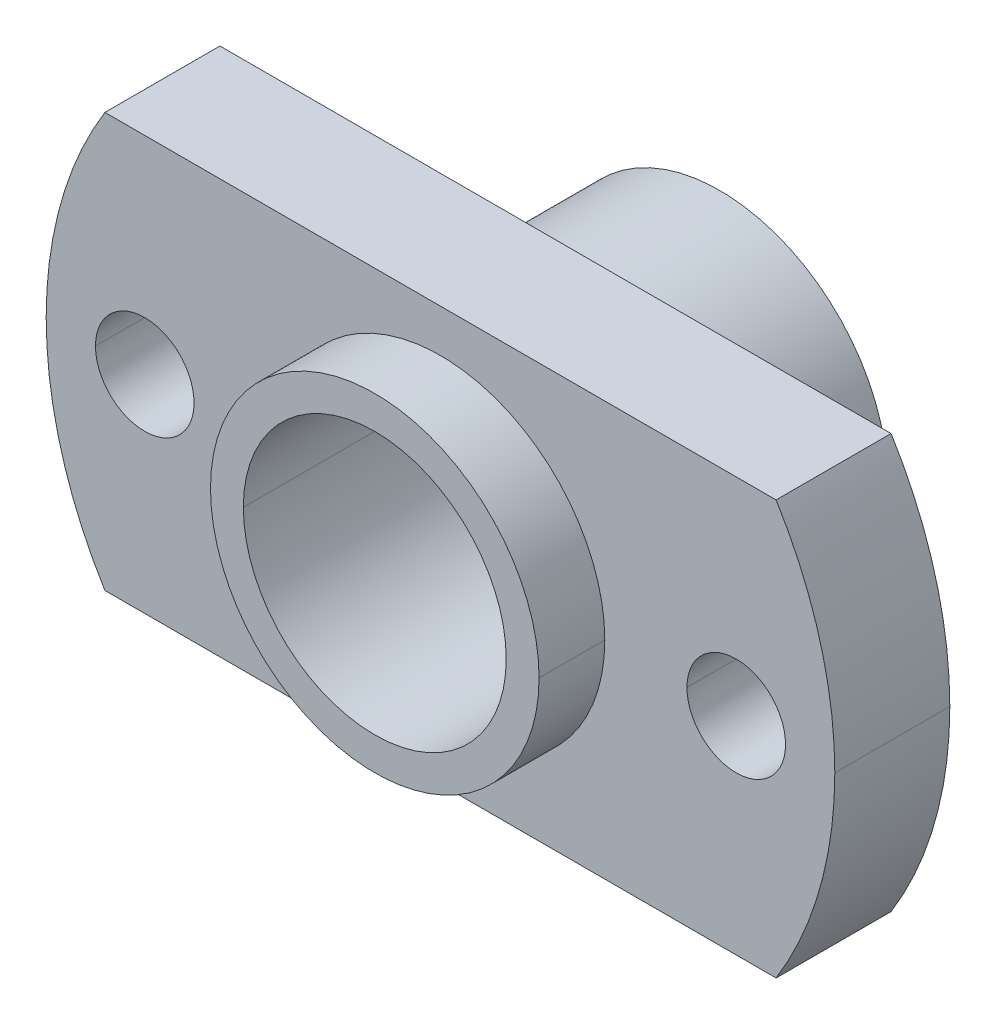
ISO-10303-21;
HEADER;
FILE_DESCRIPTION(('STEP AP214'),'2;1');
FILE_NAME('part.step','',(''),(''),'','','');
FILE_SCHEMA(('AUTOMOTIVE_DESIGN { 1 0 10303 214 1 1 1 1 }'));
ENDSEC;
DATA;
#1=APPLICATION_CONTEXT('core data for automotive mechanical design processes');
#2=APPLICATION_PROTOCOL_DEFINITION('international standard','automotive_design',2000,#1);
#3=PRODUCT_CONTEXT('',#1,'mechanical');
#4=PRODUCT('Part','Part','',(#3));
#5=PRODUCT_RELATED_PRODUCT_CATEGORY('part','',(#4));
#6=PRODUCT_DEFINITION_FORMATION('','',#4);
#7=PRODUCT_DEFINITION_CONTEXT('part definition',#1,'design');
#8=PRODUCT_DEFINITION('design','',#6,#7);
#9=PRODUCT_DEFINITION_SHAPE('','',#8);
#10=(LENGTH_UNIT() NAMED_UNIT(*) SI_UNIT(.MILLI.,.METRE.));
#11=(NAMED_UNIT(*) PLANE_ANGLE_UNIT() SI_UNIT($,.RADIAN.));
#12=(NAMED_UNIT(*) SI_UNIT($,.STERADIAN.) SOLID_ANGLE_UNIT());
#13=UNCERTAINTY_MEASURE_WITH_UNIT(LENGTH_MEASURE(1.E-05),#10,'distance_accuracy_value','');
#14=(GEOMETRIC_REPRESENTATION_CONTEXT(3) GLOBAL_UNCERTAINTY_ASSIGNED_CONTEXT((#13)) GLOBAL_UNIT_ASSIGNED_CONTEXT((#10,
#11,#12)) REPRESENTATION_CONTEXT('',''));
#15=CARTESIAN_POINT('',(0.,0.,0.));
#16=DIRECTION('',(0.,0.,1.));
#17=DIRECTION('',(1.,0.,0.));
#18=AXIS2_PLACEMENT_3D('',#15,#16,#17);
#19=CARTESIAN_POINT('',(0.,0.,2.));
#20=DIRECTION('',(0.,0.,-1.));
#21=DIRECTION('',(-1.,0.,0.));
#22=AXIS2_PLACEMENT_3D('',#19,#20,#21);
#23=CYLINDRICAL_SURFACE('',#22,4.);
#24=DIRECTION('',(0.,0.,-1.));
#25=VECTOR('',#24,1.);
#26=CARTESIAN_POINT('',(4.,0.,2.));
#27=LINE('',#26,#25);
#28=CARTESIAN_POINT('',(4.,0.,2.));
#29=VERTEX_POINT('',#28);
#30=CARTESIAN_POINT('',(4.,0.,-8.5));
#31=VERTEX_POINT('',#30);
#32=EDGE_CURVE('E174',#29,#31,#27,.T.);
#33=ORIENTED_EDGE('',*,*,#32,.F.);
#34=CARTESIAN_POINT('',(0.,0.,2.));
#35=DIRECTION('',(0.,0.,-1.));
#36=DIRECTION('',(-1.,0.,0.));
#37=AXIS2_PLACEMENT_3D('',#34,#35,#36);
#38=CIRCLE('',#37,4.);
#39=CARTESIAN_POINT('',(-4.,0.,2.));
#40=VERTEX_POINT('',#39);
#41=EDGE_CURVE('E161',#40,#29,#38,.T.);
#42=ORIENTED_EDGE('',*,*,#41,.F.);
#43=DIRECTION('',(0.,0.,-1.));
#44=VECTOR('',#43,1.);
#45=CARTESIAN_POINT('',(-4.,0.,2.));
#46=LINE('',#45,#44);
#47=CARTESIAN_POINT('',(-4.,0.,-8.5));
#48=VERTEX_POINT('',#47);
#49=EDGE_CURVE('E182',#40,#48,#46,.T.);
#50=ORIENTED_EDGE('',*,*,#49,.T.);
#51=CARTESIAN_POINT('',(0.,0.,-8.5));
#52=DIRECTION('',(0.,0.,-1.));
#53=DIRECTION('',(-1.,0.,0.));
#54=AXIS2_PLACEMENT_3D('',#51,#52,#53);
#55=CIRCLE('',#54,4.);
#56=EDGE_CURVE('E11',#48,#31,#55,.T.);
#57=ORIENTED_EDGE('',*,*,#56,.T.);
#58=EDGE_LOOP('',(#33,#42,#50,#57));
#59=FACE_BOUND('',#58,.T.);
#60=ADVANCED_FACE('F17',(#59),#23,.F.);
#61=CARTESIAN_POINT('',(0.,0.,-8.5));
#62=DIRECTION('',(0.,0.,-1.));
#63=DIRECTION('',(0.,-1.,0.));
#64=AXIS2_PLACEMENT_3D('',#61,#62,#63);
#65=PLANE('',#64);
#66=ORIENTED_EDGE('',*,*,#56,.F.);
#67=CARTESIAN_POINT('',(0.,0.,-8.5));
#68=DIRECTION('',(0.,0.,-1.));
#69=DIRECTION('',(-1.,0.,0.));
#70=AXIS2_PLACEMENT_3D('',#67,#68,#69);
#71=CIRCLE('',#70,4.);
#72=EDGE_CURVE('E179',#31,#48,#71,.T.);
#73=ORIENTED_EDGE('',*,*,#72,.F.);
#74=EDGE_LOOP('',(#66,#73));
#75=FACE_BOUND('',#74,.T.);
#76=CARTESIAN_POINT('',(0.,0.,-8.5));
#77=DIRECTION('',(0.,0.,-1.));
#78=DIRECTION('',(-1.,0.,0.));
#79=AXIS2_PLACEMENT_3D('',#76,#77,#78);
#80=CIRCLE('',#79,5.1);
#81=CARTESIAN_POINT('',(5.1,0.,-8.5));
#82=VERTEX_POINT('',#81);
#83=CARTESIAN_POINT('',(-5.1,0.,-8.5));
#84=VERTEX_POINT('',#83);
#85=EDGE_CURVE('E25',#82,#84,#80,.T.);
#86=ORIENTED_EDGE('',*,*,#85,.T.);
#87=CARTESIAN_POINT('',(0.,0.,-8.5));
#88=DIRECTION('',(0.,0.,-1.));
#89=DIRECTION('',(-1.,0.,0.));
#90=AXIS2_PLACEMENT_3D('',#87,#88,#89);
#91=CIRCLE('',#90,5.1);
#92=EDGE_CURVE('E214',#84,#82,#91,.T.);
#93=ORIENTED_EDGE('',*,*,#92,.T.);
#94=EDGE_LOOP('',(#86,#93));
#95=FACE_BOUND('',#94,.T.);
#96=ADVANCED_FACE('F331',(#75,#95),#65,.T.);
#97=CARTESIAN_POINT('',(0.,0.,-8.5));
#98=DIRECTION('',(0.,0.,1.));
#99=DIRECTION('',(1.,0.,0.));
#100=AXIS2_PLACEMENT_3D('',#97,#98,#99);
#101=CYLINDRICAL_SURFACE('',#100,5.1);
#102=DIRECTION('',(0.,0.,1.));
#103=VECTOR('',#102,1.);
#104=CARTESIAN_POINT('',(-5.1,0.,-8.5));
#105=LINE('',#104,#103);
#106=CARTESIAN_POINT('',(-5.1,0.,-3.5));
#107=VERTEX_POINT('',#106);
#108=EDGE_CURVE('E218',#84,#107,#105,.T.);
#109=ORIENTED_EDGE('',*,*,#108,.F.);
#110=ORIENTED_EDGE('',*,*,#85,.F.);
#111=DIRECTION('',(0.,0.,1.));
#112=VECTOR('',#111,1.);
#113=CARTESIAN_POINT('',(5.1,0.,-8.5));
#114=LINE('',#113,#112);
#115=CARTESIAN_POINT('',(5.1,0.,-3.5));
#116=VERTEX_POINT('',#115);
#117=EDGE_CURVE('E228',#82,#116,#114,.T.);
#118=ORIENTED_EDGE('',*,*,#117,.T.);
#119=CARTESIAN_POINT('',(0.,0.,-3.5));
#120=DIRECTION('',(0.,0.,-1.));
#121=DIRECTION('',(1.,0.,0.));
#122=AXIS2_PLACEMENT_3D('',#119,#120,#121);
#123=CIRCLE('',#122,5.1);
#124=EDGE_CURVE('E307',#116,#107,#123,.T.);
#125=ORIENTED_EDGE('',*,*,#124,.T.);
#126=EDGE_LOOP('',(#109,#110,#118,#125));
#127=FACE_BOUND('',#126,.T.);
#128=ADVANCED_FACE('F335',(#127),#101,.T.);
#129=CARTESIAN_POINT('',(0.,0.,2.));
#130=DIRECTION('',(0.,0.,1.));
#131=DIRECTION('',(1.,0.,0.));
#132=AXIS2_PLACEMENT_3D('',#129,#130,#131);
#133=PLANE('',#132);
#134=ORIENTED_EDGE('',*,*,#41,.T.);
#135=CARTESIAN_POINT('',(0.,0.,2.));
#136=DIRECTION('',(0.,0.,-1.));
#137=DIRECTION('',(-1.,0.,0.));
#138=AXIS2_PLACEMENT_3D('',#135,#136,#137);
#139=CIRCLE('',#138,4.);
#140=EDGE_CURVE('E166',#29,#40,#139,.T.);
#141=ORIENTED_EDGE('',*,*,#140,.T.);
#142=EDGE_LOOP('',(#134,#141));
#143=FACE_BOUND('',#142,.T.);
#144=CARTESIAN_POINT('',(0.,0.,2.));
#145=DIRECTION('',(0.,0.,1.));
#146=DIRECTION('',(1.,0.,0.));
#147=AXIS2_PLACEMENT_3D('',#144,#145,#146);
#148=CIRCLE('',#147,5.);
#149=CARTESIAN_POINT('',(-5.,0.,2.));
#150=VERTEX_POINT('',#149);
#151=CARTESIAN_POINT('',(5.,0.,2.));
#152=VERTEX_POINT('',#151);
#153=EDGE_CURVE('E171',#150,#152,#148,.T.);
#154=ORIENTED_EDGE('',*,*,#153,.T.);
#155=CARTESIAN_POINT('',(0.,0.,2.));
#156=DIRECTION('',(0.,0.,1.));
#157=DIRECTION('',(1.,0.,0.));
#158=AXIS2_PLACEMENT_3D('',#155,#156,#157);
#159=CIRCLE('',#158,5.);
#160=EDGE_CURVE('E232',#152,#150,#159,.T.);
#161=ORIENTED_EDGE('',*,*,#160,.T.);
#162=EDGE_LOOP('',(#154,#161));
#163=FACE_BOUND('',#162,.T.);
#164=ADVANCED_FACE('F163',(#143,#163),#133,.T.);
#165=CARTESIAN_POINT('',(0.,0.,2.));
#166=DIRECTION('',(0.,0.,-1.));
#167=DIRECTION('',(-1.,0.,0.));
#168=AXIS2_PLACEMENT_3D('',#165,#166,#167);
#169=CYLINDRICAL_SURFACE('',#168,5.);
#170=DIRECTION('',(0.,0.,-1.));
#171=VECTOR('',#170,1.);
#172=CARTESIAN_POINT('',(5.,0.,2.));
#173=LINE('',#172,#171);
#174=CARTESIAN_POINT('',(5.,0.,0.));
#175=VERTEX_POINT('',#174);
#176=EDGE_CURVE('E199',#152,#175,#173,.T.);
#177=ORIENTED_EDGE('',*,*,#176,.F.);
#178=ORIENTED_EDGE('',*,*,#153,.F.);
#179=DIRECTION('',(0.,0.,-1.));
#180=VECTOR('',#179,1.);
#181=CARTESIAN_POINT('',(-5.,0.,2.));
#182=LINE('',#181,#180);
#183=CARTESIAN_POINT('',(-5.,0.,0.));
#184=VERTEX_POINT('',#183);
#185=EDGE_CURVE('E194',#150,#184,#182,.T.);
#186=ORIENTED_EDGE('',*,*,#185,.T.);
#187=CARTESIAN_POINT('',(0.,0.,0.));
#188=DIRECTION('',(0.,0.,1.));
#189=DIRECTION('',(1.,0.,0.));
#190=AXIS2_PLACEMENT_3D('',#187,#188,#189);
#191=CIRCLE('',#190,5.);
#192=EDGE_CURVE('E316',#184,#175,#191,.T.);
#193=ORIENTED_EDGE('',*,*,#192,.T.);
#194=EDGE_LOOP('',(#177,#178,#186,#193));
#195=FACE_BOUND('',#194,.T.);
#196=ADVANCED_FACE('F385',(#195),#169,.T.);
#197=CARTESIAN_POINT('',(9.,0.,-3.5));
#198=DIRECTION('',(0.,0.,1.));
#199=DIRECTION('',(1.,0.,0.));
#200=AXIS2_PLACEMENT_3D('',#197,#198,#199);
#201=CYLINDRICAL_SURFACE('',#200,1.5);
#202=DIRECTION('',(0.,0.,1.));
#203=VECTOR('',#202,1.);
#204=CARTESIAN_POINT('',(7.5,0.,-3.5));
#205=LINE('',#204,#203);
#206=CARTESIAN_POINT('',(7.5,0.,-3.5));
#207=VERTEX_POINT('',#206);
#208=CARTESIAN_POINT('',(7.5,0.,0.));
#209=VERTEX_POINT('',#208);
#210=EDGE_CURVE('E193',#207,#209,#205,.T.);
#211=ORIENTED_EDGE('',*,*,#210,.F.);
#212=CARTESIAN_POINT('',(9.,0.,-3.5));
#213=DIRECTION('',(0.,0.,1.));
#214=DIRECTION('',(-1.,0.,0.));
#215=AXIS2_PLACEMENT_3D('',#212,#213,#214);
#216=CIRCLE('',#215,1.5);
#217=CARTESIAN_POINT('',(10.5,0.,-3.5));
#218=VERTEX_POINT('',#217);
#219=EDGE_CURVE('E308',#218,#207,#216,.T.);
#220=ORIENTED_EDGE('',*,*,#219,.F.);
#221=DIRECTION('',(0.,0.,1.));
#222=VECTOR('',#221,1.);
#223=CARTESIAN_POINT('',(10.5,0.,-3.5));
#224=LINE('',#223,#222);
#225=CARTESIAN_POINT('',(10.5,0.,0.));
#226=VERTEX_POINT('',#225);
#227=EDGE_CURVE('E237',#218,#226,#224,.T.);
#228=ORIENTED_EDGE('',*,*,#227,.T.);
#229=CARTESIAN_POINT('',(9.,0.,0.));
#230=DIRECTION('',(0.,0.,1.));
#231=DIRECTION('',(-1.,0.,0.));
#232=AXIS2_PLACEMENT_3D('',#229,#230,#231);
#233=CIRCLE('',#232,1.5);
#234=EDGE_CURVE('E319',#226,#209,#233,.T.);
#235=ORIENTED_EDGE('',*,*,#234,.T.);
#236=EDGE_LOOP('',(#211,#220,#228,#235));
#237=FACE_BOUND('',#236,.T.);
#238=ADVANCED_FACE('F387',(#237),#201,.F.);
#239=CARTESIAN_POINT('',(-9.,0.,-3.5));
#240=DIRECTION('',(0.,0.,1.));
#241=DIRECTION('',(1.,0.,0.));
#242=AXIS2_PLACEMENT_3D('',#239,#240,#241);
#243=CYLINDRICAL_SURFACE('',#242,1.5);
#244=DIRECTION('',(0.,0.,1.));
#245=VECTOR('',#244,1.);
#246=CARTESIAN_POINT('',(-10.5,0.,-3.5));
#247=LINE('',#246,#245);
#248=CARTESIAN_POINT('',(-10.5,0.,-3.5));
#249=VERTEX_POINT('',#248);
#250=CARTESIAN_POINT('',(-10.5,0.,0.));
#251=VERTEX_POINT('',#250);
#252=EDGE_CURVE('E261',#249,#251,#247,.T.);
#253=ORIENTED_EDGE('',*,*,#252,.F.);
#254=CARTESIAN_POINT('',(-9.,0.,-3.5));
#255=DIRECTION('',(0.,0.,1.));
#256=DIRECTION('',(1.,0.,0.));
#257=AXIS2_PLACEMENT_3D('',#254,#255,#256);
#258=CIRCLE('',#257,1.5);
#259=CARTESIAN_POINT('',(-7.5,0.,-3.5));
#260=VERTEX_POINT('',#259);
#261=EDGE_CURVE('E311',#260,#249,#258,.T.);
#262=ORIENTED_EDGE('',*,*,#261,.F.);
#263=DIRECTION('',(0.,0.,1.));
#264=VECTOR('',#263,1.);
#265=CARTESIAN_POINT('',(-7.5,0.,-3.5));
#266=LINE('',#265,#264);
#267=CARTESIAN_POINT('',(-7.5,0.,0.));
#268=VERTEX_POINT('',#267);
#269=EDGE_CURVE('E200',#260,#268,#266,.T.);
#270=ORIENTED_EDGE('',*,*,#269,.T.);
#271=CARTESIAN_POINT('',(-9.,0.,0.));
#272=DIRECTION('',(0.,0.,1.));
#273=DIRECTION('',(1.,0.,0.));
#274=AXIS2_PLACEMENT_3D('',#271,#272,#273);
#275=CIRCLE('',#274,1.5);
#276=EDGE_CURVE('E322',#268,#251,#275,.T.);
#277=ORIENTED_EDGE('',*,*,#276,.T.);
#278=EDGE_LOOP('',(#253,#262,#270,#277));
#279=FACE_BOUND('',#278,.T.);
#280=ADVANCED_FACE('F390',(#279),#243,.F.);
#281=CARTESIAN_POINT('',(0.,0.,0.));
#282=DIRECTION('',(0.,0.,1.));
#283=DIRECTION('',(1.,0.,0.));
#284=AXIS2_PLACEMENT_3D('',#281,#282,#283);
#285=PLANE('',#284);
#286=ORIENTED_EDGE('',*,*,#276,.F.);
#287=CARTESIAN_POINT('',(-9.,0.,0.));
#288=DIRECTION('',(0.,0.,1.));
#289=DIRECTION('',(1.,0.,0.));
#290=AXIS2_PLACEMENT_3D('',#287,#288,#289);
#291=CIRCLE('',#290,1.5);
#292=EDGE_CURVE('E204',#251,#268,#291,.T.);
#293=ORIENTED_EDGE('',*,*,#292,.F.);
#294=EDGE_LOOP('',(#286,#293));
#295=FACE_BOUND('',#294,.T.);
#296=ORIENTED_EDGE('',*,*,#234,.F.);
#297=CARTESIAN_POINT('',(9.,0.,0.));
#298=DIRECTION('',(0.,0.,1.));
#299=DIRECTION('',(-1.,0.,0.));
#300=AXIS2_PLACEMENT_3D('',#297,#298,#299);
#301=CIRCLE('',#300,1.5);
#302=EDGE_CURVE('E233',#209,#226,#301,.T.);
#303=ORIENTED_EDGE('',*,*,#302,.F.);
#304=EDGE_LOOP('',(#296,#303));
#305=FACE_BOUND('',#304,.T.);
#306=ORIENTED_EDGE('',*,*,#192,.F.);
#307=CARTESIAN_POINT('',(0.,0.,0.));
#308=DIRECTION('',(0.,0.,1.));
#309=DIRECTION('',(1.,0.,0.));
#310=AXIS2_PLACEMENT_3D('',#307,#308,#309);
#311=CIRCLE('',#310,5.);
#312=EDGE_CURVE('E195',#175,#184,#311,.T.);
#313=ORIENTED_EDGE('',*,*,#312,.F.);
#314=EDGE_LOOP('',(#306,#313));
#315=FACE_BOUND('',#314,.T.);
#316=CARTESIAN_POINT('',(0.,0.,0.));
#317=DIRECTION('',(0.,0.,1.));
#318=DIRECTION('',(1.,0.,0.));
#319=AXIS2_PLACEMENT_3D('',#316,#317,#318);
#320=CIRCLE('',#319,12.);
#321=CARTESIAN_POINT('',(-10.2132267183295,6.3,0.));
#322=VERTEX_POINT('',#321);
#323=CARTESIAN_POINT('',(-10.2132267183295,-6.3,0.));
#324=VERTEX_POINT('',#323);
#325=EDGE_CURVE('E276',#322,#324,#320,.T.);
#326=ORIENTED_EDGE('',*,*,#325,.T.);
#327=DIRECTION('',(1.,0.,0.));
#328=VECTOR('',#327,1.);
#329=CARTESIAN_POINT('',(-10.2132267183295,-6.3,0.));
#330=LINE('',#329,#328);
#331=CARTESIAN_POINT('',(10.2132267183295,-6.3,0.));
#332=VERTEX_POINT('',#331);
#333=EDGE_CURVE('E247',#324,#332,#330,.T.);
#334=ORIENTED_EDGE('',*,*,#333,.T.);
#335=CARTESIAN_POINT('',(0.,0.,0.));
#336=DIRECTION('',(0.,0.,1.));
#337=DIRECTION('',(1.,0.,0.));
#338=AXIS2_PLACEMENT_3D('',#335,#336,#337);
#339=CIRCLE('',#338,12.);
#340=CARTESIAN_POINT('',(12.,0.,0.));
#341=VERTEX_POINT('',#340);
#342=EDGE_CURVE('E275',#332,#341,#339,.T.);
#343=ORIENTED_EDGE('',*,*,#342,.T.);
#344=CARTESIAN_POINT('',(0.,0.,0.));
#345=DIRECTION('',(0.,0.,1.));
#346=DIRECTION('',(1.,0.,0.));
#347=AXIS2_PLACEMENT_3D('',#344,#345,#346);
#348=CIRCLE('',#347,12.);
#349=CARTESIAN_POINT('',(10.2132267183295,6.3,0.));
#350=VERTEX_POINT('',#349);
#351=EDGE_CURVE('E49',#341,#350,#348,.T.);
#352=ORIENTED_EDGE('',*,*,#351,.T.);
#353=DIRECTION('',(-1.,0.,0.));
#354=VECTOR('',#353,1.);
#355=CARTESIAN_POINT('',(-10.2132267183295,6.3,0.));
#356=LINE('',#355,#354);
#357=EDGE_CURVE('E212',#350,#322,#356,.T.);
#358=ORIENTED_EDGE('',*,*,#357,.T.);
#359=EDGE_LOOP('',(#326,#334,#343,#352,#358));
#360=FACE_BOUND('',#359,.T.);
#361=ADVANCED_FACE('F344',(#295,#305,#315,#360),#285,.T.);
#362=CARTESIAN_POINT('',(0.,0.,-3.5));
#363=DIRECTION('',(0.,0.,1.));
#364=DIRECTION('',(1.,0.,0.));
#365=AXIS2_PLACEMENT_3D('',#362,#363,#364);
#366=PLANE('',#365);
#367=ORIENTED_EDGE('',*,*,#261,.T.);
#368=CARTESIAN_POINT('',(-9.,0.,-3.5));
#369=DIRECTION('',(0.,0.,1.));
#370=DIRECTION('',(1.,0.,0.));
#371=AXIS2_PLACEMENT_3D('',#368,#369,#370);
#372=CIRCLE('',#371,1.5);
#373=EDGE_CURVE('E257',#249,#260,#372,.T.);
#374=ORIENTED_EDGE('',*,*,#373,.T.);
#375=EDGE_LOOP('',(#367,#374));
#376=FACE_BOUND('',#375,.T.);
#377=ORIENTED_EDGE('',*,*,#219,.T.);
#378=CARTESIAN_POINT('',(9.,0.,-3.5));
#379=DIRECTION('',(0.,0.,1.));
#380=DIRECTION('',(-1.,0.,0.));
#381=AXIS2_PLACEMENT_3D('',#378,#379,#380);
#382=CIRCLE('',#381,1.5);
#383=EDGE_CURVE('E189',#207,#218,#382,.T.);
#384=ORIENTED_EDGE('',*,*,#383,.T.);
#385=EDGE_LOOP('',(#377,#384));
#386=FACE_BOUND('',#385,.T.);
#387=ORIENTED_EDGE('',*,*,#124,.F.);
#388=CARTESIAN_POINT('',(0.,0.,-3.5));
#389=DIRECTION('',(0.,0.,-1.));
#390=DIRECTION('',(1.,0.,0.));
#391=AXIS2_PLACEMENT_3D('',#388,#389,#390);
#392=CIRCLE('',#391,5.1);
#393=EDGE_CURVE('E224',#107,#116,#392,.T.);
#394=ORIENTED_EDGE('',*,*,#393,.F.);
#395=EDGE_LOOP('',(#387,#394));
#396=FACE_BOUND('',#395,.T.);
#397=CARTESIAN_POINT('',(0.,0.,-3.5));
#398=DIRECTION('',(0.,0.,1.));
#399=DIRECTION('',(1.,0.,0.));
#400=AXIS2_PLACEMENT_3D('',#397,#398,#399);
#401=CIRCLE('',#400,12.);
#402=CARTESIAN_POINT('',(-10.2132267183295,6.3,-3.5));
#403=VERTEX_POINT('',#402);
#404=CARTESIAN_POINT('',(-10.2132267183295,-6.3,-3.5));
#405=VERTEX_POINT('',#404);
#406=EDGE_CURVE('E213',#403,#405,#401,.T.);
#407=ORIENTED_EDGE('',*,*,#406,.F.);
#408=DIRECTION('',(-1.,0.,0.));
#409=VECTOR('',#408,1.);
#410=CARTESIAN_POINT('',(-10.2132267183295,6.3,-3.5));
#411=LINE('',#410,#409);
#412=CARTESIAN_POINT('',(10.2132267183295,6.3,-3.5));
#413=VERTEX_POINT('',#412);
#414=EDGE_CURVE('E298',#413,#403,#411,.T.);
#415=ORIENTED_EDGE('',*,*,#414,.F.);
#416=CARTESIAN_POINT('',(0.,0.,-3.5));
#417=DIRECTION('',(0.,0.,1.));
#418=DIRECTION('',(1.,0.,0.));
#419=AXIS2_PLACEMENT_3D('',#416,#417,#418);
#420=CIRCLE('',#419,12.);
#421=CARTESIAN_POINT('',(12.,0.,-3.5));
#422=VERTEX_POINT('',#421);
#423=EDGE_CURVE('E38',#422,#413,#420,.T.);
#424=ORIENTED_EDGE('',*,*,#423,.F.);
#425=CARTESIAN_POINT('',(0.,0.,-3.5));
#426=DIRECTION('',(0.,0.,1.));
#427=DIRECTION('',(1.,0.,0.));
#428=AXIS2_PLACEMENT_3D('',#425,#426,#427);
#429=CIRCLE('',#428,12.);
#430=CARTESIAN_POINT('',(10.2132267183295,-6.3,-3.5));
#431=VERTEX_POINT('',#430);
#432=EDGE_CURVE('E203',#431,#422,#429,.T.);
#433=ORIENTED_EDGE('',*,*,#432,.F.);
#434=DIRECTION('',(1.,0.,0.));
#435=VECTOR('',#434,1.);
#436=CARTESIAN_POINT('',(-10.2132267183295,-6.3,-3.5));
#437=LINE('',#436,#435);
#438=EDGE_CURVE('E250',#405,#431,#437,.T.);
#439=ORIENTED_EDGE('',*,*,#438,.F.);
#440=EDGE_LOOP('',(#407,#415,#424,#433,#439));
#441=FACE_BOUND('',#440,.T.);
#442=ADVANCED_FACE('F340',(#376,#386,#396,#441),#366,.F.);
#443=CARTESIAN_POINT('',(-10.2132267183295,-6.3,-3.5));
#444=DIRECTION('',(0.,-1.,0.));
#445=DIRECTION('',(0.,0.,-1.));
#446=AXIS2_PLACEMENT_3D('',#443,#444,#445);
#447=PLANE('',#446);
#448=ORIENTED_EDGE('',*,*,#333,.F.);
#449=DIRECTION('',(0.,0.,1.));
#450=VECTOR('',#449,1.);
#451=CARTESIAN_POINT('',(-10.2132267183295,-6.3,-3.5));
#452=LINE('',#451,#450);
#453=EDGE_CURVE('E208',#405,#324,#452,.T.);
#454=ORIENTED_EDGE('',*,*,#453,.F.);
#455=ORIENTED_EDGE('',*,*,#438,.T.);
#456=DIRECTION('',(0.,0.,1.));
#457=VECTOR('',#456,1.);
#458=CARTESIAN_POINT('',(10.2132267183295,-6.3,-3.5));
#459=LINE('',#458,#457);
#460=EDGE_CURVE('E281',#431,#332,#459,.T.);
#461=ORIENTED_EDGE('',*,*,#460,.T.);
#462=EDGE_LOOP('',(#448,#454,#455,#461));
#463=FACE_BOUND('',#462,.T.);
#464=ADVANCED_FACE('F343',(#463),#447,.T.);
#465=CARTESIAN_POINT('',(0.,0.,-3.5));
#466=DIRECTION('',(0.,0.,1.));
#467=DIRECTION('',(1.,0.,0.));
#468=AXIS2_PLACEMENT_3D('',#465,#466,#467);
#469=CYLINDRICAL_SURFACE('',#468,12.);
#470=DIRECTION('',(0.,0.,1.));
#471=VECTOR('',#470,1.);
#472=CARTESIAN_POINT('',(12.,0.,-3.5));
#473=LINE('',#472,#471);
#474=EDGE_CURVE('E271',#422,#341,#473,.T.);
#475=ORIENTED_EDGE('',*,*,#474,.F.);
#476=ORIENTED_EDGE('',*,*,#423,.T.);
#477=DIRECTION('',(0.,0.,1.));
#478=VECTOR('',#477,1.);
#479=CARTESIAN_POINT('',(10.2132267183295,6.3,-3.5));
#480=LINE('',#479,#478);
#481=EDGE_CURVE('E295',#413,#350,#480,.T.);
#482=ORIENTED_EDGE('',*,*,#481,.T.);
#483=ORIENTED_EDGE('',*,*,#351,.F.);
#484=EDGE_LOOP('',(#475,#476,#482,#483));
#485=FACE_BOUND('',#484,.T.);
#486=ADVANCED_FACE('F358',(#485),#469,.T.);
#487=CARTESIAN_POINT('',(-10.2132267183295,6.3,-3.5));
#488=DIRECTION('',(0.,1.,0.));
#489=DIRECTION('',(1.,0.,0.));
#490=AXIS2_PLACEMENT_3D('',#487,#488,#489);
#491=PLANE('',#490);
#492=ORIENTED_EDGE('',*,*,#357,.F.);
#493=ORIENTED_EDGE('',*,*,#481,.F.);
#494=ORIENTED_EDGE('',*,*,#414,.T.);
#495=DIRECTION('',(0.,0.,1.));
#496=VECTOR('',#495,1.);
#497=CARTESIAN_POINT('',(-10.2132267183295,6.3,-3.5));
#498=LINE('',#497,#496);
#499=EDGE_CURVE('E280',#403,#322,#498,.T.);
#500=ORIENTED_EDGE('',*,*,#499,.T.);
#501=EDGE_LOOP('',(#492,#493,#494,#500));
#502=FACE_BOUND('',#501,.T.);
#503=ADVANCED_FACE('F357',(#502),#491,.T.);
#504=CARTESIAN_POINT('',(0.,0.,-3.5));
#505=DIRECTION('',(0.,0.,1.));
#506=DIRECTION('',(1.,0.,0.));
#507=AXIS2_PLACEMENT_3D('',#504,#505,#506);
#508=CYLINDRICAL_SURFACE('',#507,12.);
#509=ORIENTED_EDGE('',*,*,#325,.F.);
#510=ORIENTED_EDGE('',*,*,#499,.F.);
#511=ORIENTED_EDGE('',*,*,#406,.T.);
#512=ORIENTED_EDGE('',*,*,#453,.T.);
#513=EDGE_LOOP('',(#509,#510,#511,#512));
#514=FACE_BOUND('',#513,.T.);
#515=ADVANCED_FACE('F354',(#514),#508,.T.);
#516=CARTESIAN_POINT('',(0.,0.,-3.5));
#517=DIRECTION('',(0.,0.,1.));
#518=DIRECTION('',(1.,0.,0.));
#519=AXIS2_PLACEMENT_3D('',#516,#517,#518);
#520=CYLINDRICAL_SURFACE('',#519,12.);
#521=ORIENTED_EDGE('',*,*,#432,.T.);
#522=ORIENTED_EDGE('',*,*,#474,.T.);
#523=ORIENTED_EDGE('',*,*,#342,.F.);
#524=ORIENTED_EDGE('',*,*,#460,.F.);
#525=EDGE_LOOP('',(#521,#522,#523,#524));
#526=FACE_BOUND('',#525,.T.);
#527=ADVANCED_FACE('F362',(#526),#520,.T.);
#528=CARTESIAN_POINT('',(-9.,0.,-3.5));
#529=DIRECTION('',(0.,0.,1.));
#530=DIRECTION('',(1.,0.,0.));
#531=AXIS2_PLACEMENT_3D('',#528,#529,#530);
#532=CYLINDRICAL_SURFACE('',#531,1.5);
#533=ORIENTED_EDGE('',*,*,#373,.F.);
#534=ORIENTED_EDGE('',*,*,#252,.T.);
#535=ORIENTED_EDGE('',*,*,#292,.T.);
#536=ORIENTED_EDGE('',*,*,#269,.F.);
#537=EDGE_LOOP('',(#533,#534,#535,#536));
#538=FACE_BOUND('',#537,.T.);
#539=ADVANCED_FACE('F415',(#538),#532,.F.);
#540=CARTESIAN_POINT('',(9.,0.,-3.5));
#541=DIRECTION('',(0.,0.,1.));
#542=DIRECTION('',(1.,0.,0.));
#543=AXIS2_PLACEMENT_3D('',#540,#541,#542);
#544=CYLINDRICAL_SURFACE('',#543,1.5);
#545=ORIENTED_EDGE('',*,*,#383,.F.);
#546=ORIENTED_EDGE('',*,*,#210,.T.);
#547=ORIENTED_EDGE('',*,*,#302,.T.);
#548=ORIENTED_EDGE('',*,*,#227,.F.);
#549=EDGE_LOOP('',(#545,#546,#547,#548));
#550=FACE_BOUND('',#549,.T.);
#551=ADVANCED_FACE('F408',(#550),#544,.F.);
#552=CARTESIAN_POINT('',(0.,0.,2.));
#553=DIRECTION('',(0.,0.,-1.));
#554=DIRECTION('',(-1.,0.,0.));
#555=AXIS2_PLACEMENT_3D('',#552,#553,#554);
#556=CYLINDRICAL_SURFACE('',#555,5.);
#557=ORIENTED_EDGE('',*,*,#160,.F.);
#558=ORIENTED_EDGE('',*,*,#176,.T.);
#559=ORIENTED_EDGE('',*,*,#312,.T.);
#560=ORIENTED_EDGE('',*,*,#185,.F.);
#561=EDGE_LOOP('',(#557,#558,#559,#560));
#562=FACE_BOUND('',#561,.T.);
#563=ADVANCED_FACE('F406',(#562),#556,.T.);
#564=CARTESIAN_POINT('',(0.,0.,-8.5));
#565=DIRECTION('',(0.,0.,1.));
#566=DIRECTION('',(1.,0.,0.));
#567=AXIS2_PLACEMENT_3D('',#564,#565,#566);
#568=CYLINDRICAL_SURFACE('',#567,5.1);
#569=ORIENTED_EDGE('',*,*,#92,.F.);
#570=ORIENTED_EDGE('',*,*,#108,.T.);
#571=ORIENTED_EDGE('',*,*,#393,.T.);
#572=ORIENTED_EDGE('',*,*,#117,.F.);
#573=EDGE_LOOP('',(#569,#570,#571,#572));
#574=FACE_BOUND('',#573,.T.);
#575=ADVANCED_FACE('F338',(#574),#568,.T.);
#576=CARTESIAN_POINT('',(0.,0.,2.));
#577=DIRECTION('',(0.,0.,-1.));
#578=DIRECTION('',(-1.,0.,0.));
#579=AXIS2_PLACEMENT_3D('',#576,#577,#578);
#580=CYLINDRICAL_SURFACE('',#579,4.);
#581=ORIENTED_EDGE('',*,*,#140,.F.);
#582=ORIENTED_EDGE('',*,*,#32,.T.);
#583=ORIENTED_EDGE('',*,*,#72,.T.);
#584=ORIENTED_EDGE('',*,*,#49,.F.);
#585=EDGE_LOOP('',(#581,#582,#583,#584));
#586=FACE_BOUND('',#585,.T.);
#587=ADVANCED_FACE('F181',(#586),#580,.F.);
#588=CLOSED_SHELL('',(#60,#96,#128,#164,#196,#238,#280,#361,#442,#464,#486,#503,#515,#527,#539,
#551,#563,#575,#587));
#589=MANIFOLD_SOLID_BREP('B1',#588);
#590=ADVANCED_BREP_SHAPE_REPRESENTATION('',(#18,#589),#14);
#591=SHAPE_DEFINITION_REPRESENTATION(#9,#590);
ENDSEC;
END-ISO-10303-21;
